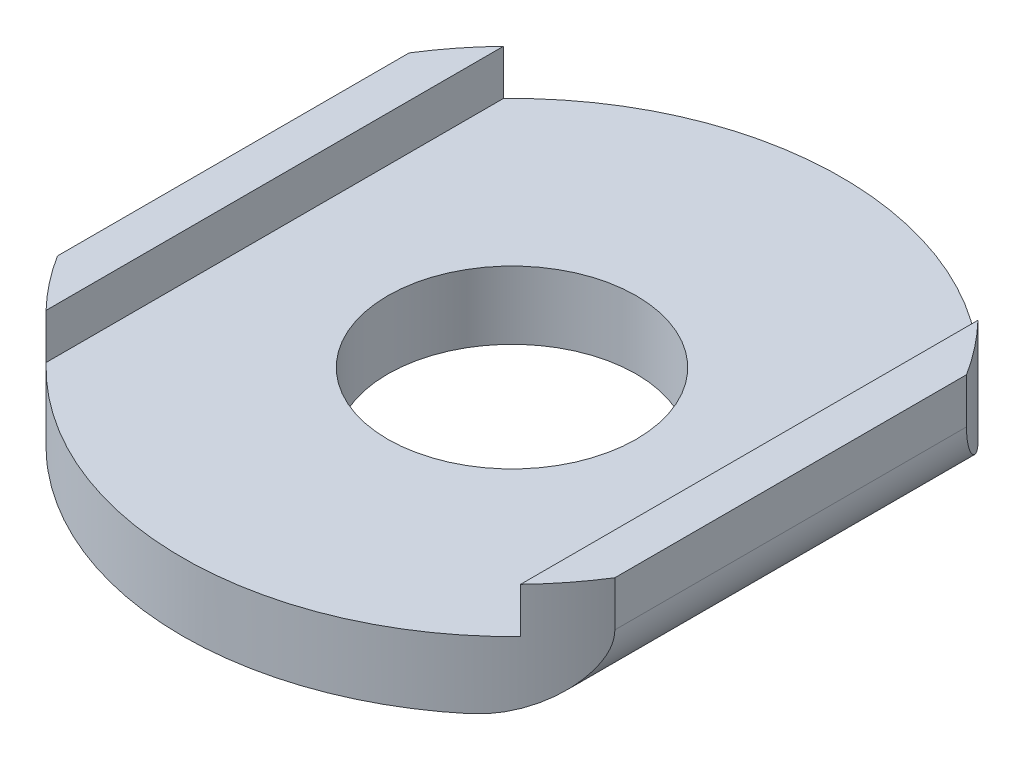
ISO-10303-21;
HEADER;
FILE_DESCRIPTION(('STEP AP214'),'2;1');
FILE_NAME('part.step','',(''),(''),'','','');
FILE_SCHEMA(('AUTOMOTIVE_DESIGN { 1 0 10303 214 1 1 1 1 }'));
ENDSEC;
DATA;
#1=APPLICATION_CONTEXT('core data for automotive mechanical design processes');
#2=APPLICATION_PROTOCOL_DEFINITION('international standard','automotive_design',2000,#1);
#3=PRODUCT_CONTEXT('',#1,'mechanical');
#4=PRODUCT('Part','Part','',(#3));
#5=PRODUCT_RELATED_PRODUCT_CATEGORY('part','',(#4));
#6=PRODUCT_DEFINITION_FORMATION('','',#4);
#7=PRODUCT_DEFINITION_CONTEXT('part definition',#1,'design');
#8=PRODUCT_DEFINITION('design','',#6,#7);
#9=PRODUCT_DEFINITION_SHAPE('','',#8);
#10=(LENGTH_UNIT() NAMED_UNIT(*) SI_UNIT(.MILLI.,.METRE.));
#11=(NAMED_UNIT(*) PLANE_ANGLE_UNIT() SI_UNIT($,.RADIAN.));
#12=(NAMED_UNIT(*) SI_UNIT($,.STERADIAN.) SOLID_ANGLE_UNIT());
#13=UNCERTAINTY_MEASURE_WITH_UNIT(LENGTH_MEASURE(1.E-05),#10,'distance_accuracy_value','');
#14=(GEOMETRIC_REPRESENTATION_CONTEXT(3) GLOBAL_UNCERTAINTY_ASSIGNED_CONTEXT((#13)) GLOBAL_UNIT_ASSIGNED_CONTEXT((#10,
#11,#12)) REPRESENTATION_CONTEXT('',''));
#15=CARTESIAN_POINT('',(0.,0.,0.));
#16=DIRECTION('',(0.,0.,1.));
#17=DIRECTION('',(1.,0.,0.));
#18=AXIS2_PLACEMENT_3D('',#15,#16,#17);
#19=CARTESIAN_POINT('',(0.,2.286,0.));
#20=DIRECTION('',(0.,1.,0.));
#21=DIRECTION('',(0.,0.,1.));
#22=AXIS2_PLACEMENT_3D('',#19,#20,#21);
#23=PLANE('',#22);
#24=DIRECTION('',(0.,0.,-1.));
#25=VECTOR('',#24,1.);
#26=CARTESIAN_POINT('',(8.001,2.286,7.71178677415292));
#27=LINE('',#26,#25);
#28=CARTESIAN_POINT('',(8.001,2.286,7.71178677415292));
#29=VERTEX_POINT('',#28);
#30=CARTESIAN_POINT('',(8.001,2.286,-7.71178677415293));
#31=VERTEX_POINT('',#30);
#32=EDGE_CURVE('E151',#29,#31,#27,.T.);
#33=ORIENTED_EDGE('',*,*,#32,.T.);
#34=CARTESIAN_POINT('',(0.,2.286,0.));
#35=DIRECTION('',(0.,1.,0.));
#36=DIRECTION('',(0.,0.,1.));
#37=AXIS2_PLACEMENT_3D('',#34,#35,#36);
#38=CIRCLE('',#37,11.1125);
#39=CARTESIAN_POINT('',(-8.001,2.286,-7.71178677415293));
#40=VERTEX_POINT('',#39);
#41=EDGE_CURVE('E208',#31,#40,#38,.T.);
#42=ORIENTED_EDGE('',*,*,#41,.T.);
#43=DIRECTION('',(0.,0.,1.));
#44=VECTOR('',#43,1.);
#45=CARTESIAN_POINT('',(-8.001,2.286,-7.71178677415293));
#46=LINE('',#45,#44);
#47=CARTESIAN_POINT('',(-8.001,2.286,7.71178677415293));
#48=VERTEX_POINT('',#47);
#49=EDGE_CURVE('E168',#40,#48,#46,.T.);
#50=ORIENTED_EDGE('',*,*,#49,.T.);
#51=EDGE_CURVE('E194',#48,#29,#38,.T.);
#52=ORIENTED_EDGE('',*,*,#51,.T.);
#53=EDGE_LOOP('',(#33,#42,#50,#52));
#54=FACE_BOUND('',#53,.T.);
#55=CARTESIAN_POINT('',(0.,2.286,0.));
#56=DIRECTION('',(0.,1.,0.));
#57=DIRECTION('',(0.,0.,1.));
#58=AXIS2_PLACEMENT_3D('',#55,#56,#57);
#59=CIRCLE('',#58,4.191);
#60=CARTESIAN_POINT('',(0.,2.286,4.191));
#61=VERTEX_POINT('',#60);
#62=EDGE_CURVE('E187',#61,#61,#59,.T.);
#63=ORIENTED_EDGE('',*,*,#62,.F.);
#64=EDGE_LOOP('',(#63));
#65=FACE_BOUND('',#64,.T.);
#66=ADVANCED_FACE('F47',(#54,#65),#23,.T.);
#67=CARTESIAN_POINT('',(0.,0.,0.));
#68=DIRECTION('',(0.,1.,0.));
#69=DIRECTION('',(0.,0.,1.));
#70=AXIS2_PLACEMENT_3D('',#67,#68,#69);
#71=PLANE('',#70);
#72=CARTESIAN_POINT('',(0.,0.,0.));
#73=DIRECTION('',(0.,1.,0.));
#74=DIRECTION('',(0.,0.,1.));
#75=AXIS2_PLACEMENT_3D('',#72,#73,#74);
#76=CIRCLE('',#75,4.191);
#77=CARTESIAN_POINT('',(0.,0.,4.191));
#78=VERTEX_POINT('',#77);
#79=EDGE_CURVE('E200',#78,#78,#76,.T.);
#80=ORIENTED_EDGE('',*,*,#79,.T.);
#81=EDGE_LOOP('',(#80));
#82=FACE_BOUND('',#81,.T.);
#83=CARTESIAN_POINT('',(0.,0.,0.));
#84=DIRECTION('',(0.,1.,0.));
#85=DIRECTION('',(0.,0.,1.));
#86=AXIS2_PLACEMENT_3D('',#83,#84,#85);
#87=CIRCLE('',#86,11.1125);
#88=CARTESIAN_POINT('',(-7.112,0.,8.5385661706167));
#89=VERTEX_POINT('',#88);
#90=CARTESIAN_POINT('',(7.112,0.,8.5385661706167));
#91=VERTEX_POINT('',#90);
#92=EDGE_CURVE('E220',#89,#91,#87,.T.);
#93=ORIENTED_EDGE('',*,*,#92,.F.);
#94=DIRECTION('',(0.,0.,-1.));
#95=VECTOR('',#94,1.);
#96=CARTESIAN_POINT('',(-7.112,0.,0.));
#97=LINE('',#96,#95);
#98=CARTESIAN_POINT('',(-7.112,0.,-8.5385661706167));
#99=VERTEX_POINT('',#98);
#100=EDGE_CURVE('E230',#89,#99,#97,.T.);
#101=ORIENTED_EDGE('',*,*,#100,.T.);
#102=CARTESIAN_POINT('',(7.112,0.,-8.5385661706167));
#103=VERTEX_POINT('',#102);
#104=EDGE_CURVE('E215',#103,#99,#87,.T.);
#105=ORIENTED_EDGE('',*,*,#104,.F.);
#106=DIRECTION('',(0.,0.,-1.));
#107=VECTOR('',#106,1.);
#108=CARTESIAN_POINT('',(7.112,0.,5.93002970060016));
#109=LINE('',#108,#107);
#110=EDGE_CURVE('E211',#103,#91,#109,.F.);
#111=ORIENTED_EDGE('',*,*,#110,.T.);
#112=EDGE_LOOP('',(#93,#101,#105,#111));
#113=FACE_BOUND('',#112,.T.);
#114=ADVANCED_FACE('F259',(#82,#113),#71,.F.);
#115=CARTESIAN_POINT('',(0.,2.286,0.));
#116=DIRECTION('',(0.,-1.,0.));
#117=DIRECTION('',(0.,0.,-1.));
#118=AXIS2_PLACEMENT_3D('',#115,#116,#117);
#119=CYLINDRICAL_SURFACE('',#118,11.1125);
#120=DIRECTION('',(0.,-1.,0.));
#121=VECTOR('',#120,1.);
#122=CARTESIAN_POINT('',(-9.398,2.286,5.93002970060016));
#123=LINE('',#122,#121);
#124=CARTESIAN_POINT('',(-9.398,3.81,5.93002970060016));
#125=VERTEX_POINT('',#124);
#126=CARTESIAN_POINT('',(-9.398,2.286,5.93002970060016));
#127=VERTEX_POINT('',#126);
#128=EDGE_CURVE('E224',#125,#127,#123,.T.);
#129=ORIENTED_EDGE('',*,*,#128,.T.);
#130=CARTESIAN_POINT('',(-9.398,2.286,5.93002970060016));
#131=CARTESIAN_POINT('',(-9.39800542832449,2.24859124822343,5.93001859917292));
#132=CARTESIAN_POINT('',(-9.39708117956693,2.21120325674337,5.93148605541066));
#133=CARTESIAN_POINT('',(-9.39342746670743,2.13678157078077,5.93727166517478));
#134=CARTESIAN_POINT('',(-9.39070018660907,2.09974750258098,5.94158636983064));
#135=CARTESIAN_POINT('',(-9.37997998796292,1.99041208395754,5.95850773639661));
#136=CARTESIAN_POINT('',(-9.36944571426099,1.91894558609183,5.97509734061076));
#137=CARTESIAN_POINT('',(-9.3387493946673,1.76111468181681,6.02298989524821));
#138=CARTESIAN_POINT('',(-9.31674949831865,1.67597599222489,6.05706526847402));
#139=CARTESIAN_POINT('',(-9.26504372086777,1.51297568733057,6.13586653105624));
#140=CARTESIAN_POINT('',(-9.23529793439938,1.43515468377865,6.18064747259055));
#141=CARTESIAN_POINT('',(-9.15042368808795,1.24328464266163,6.30602489991684));
#142=CARTESIAN_POINT('',(-9.09067490494017,1.13495596669138,6.39216265413357));
#143=CARTESIAN_POINT('',(-8.95982512122971,0.934828690230264,6.57433549692152));
#144=CARTESIAN_POINT('',(-8.8886976200423,0.843069768981605,6.67039349960054));
#145=CARTESIAN_POINT('',(-8.75425253669401,0.693367743048383,6.84543820866373));
#146=CARTESIAN_POINT('',(-8.69280517246391,0.632469683061008,6.92337422399777));
#147=CARTESIAN_POINT('',(-8.56479726036357,0.518939682055099,7.08111731530681));
#148=CARTESIAN_POINT('',(-8.49823414869888,0.466311926517888,7.16092531533631));
#149=CARTESIAN_POINT('',(-8.36044167379823,0.369156618210445,7.32132846328396));
#150=CARTESIAN_POINT('',(-8.28921488600291,0.324624645140967,7.40192315618372));
#151=CARTESIAN_POINT('',(-8.14236126625213,0.243653144980316,7.56316722621634));
#152=CARTESIAN_POINT('',(-8.06673463931575,0.207213241203928,7.64381660062842));
#153=CARTESIAN_POINT('',(-7.92144639462134,0.146852611877388,7.79408807302852));
#154=CARTESIAN_POINT('',(-7.85228078225119,0.121921714577022,7.86378555079576));
#155=CARTESIAN_POINT('',(-7.71108053291243,0.0786602923968829,8.00229177075103));
#156=CARTESIAN_POINT('',(-7.63904660548163,0.0603281463052077,8.07110072722427));
#157=CARTESIAN_POINT('',(-7.4924692371833,0.0306452971306605,8.20734678390782));
#158=CARTESIAN_POINT('',(-7.41792946670669,0.0192848153603831,8.27478567675706));
#159=CARTESIAN_POINT('',(-7.26656946250003,0.00396538627212807,8.4080233279135));
#160=CARTESIAN_POINT('',(-7.18974766416919,1.16419608203905E-05,8.47382090125403));
#161=CARTESIAN_POINT('',(-7.112,0.,8.5385661706167));
#162=B_SPLINE_CURVE_WITH_KNOTS('',3,(#130,#131,#132,#133,#134,#135,#136,#137,#138,#139,#140,
#141,#142,#143,#144,#145,#146,#147,#148,#149,#150,#151,#152,#153,#154,#155,#156,#157,#158,#159,
#160,#161),.UNSPECIFIED.,.F.,.F.,(4,2,2,2,2,2,2,2,2,2,2,2,2,2,2,4),(0.,0.112148194286111,
0.224160792267741,0.445430951034699,0.726799482247436,1.00964728055068,1.45940279909495,
1.91022145389977,2.25911155288715,2.60817765538779,2.9570525915186,3.30591128414157,
3.60958774073972,3.91318953768723,4.21636451352214,4.51975238076639),.UNSPECIFIED.);
#163=EDGE_CURVE('E57',#127,#89,#162,.T.);
#164=ORIENTED_EDGE('',*,*,#163,.T.);
#165=ORIENTED_EDGE('',*,*,#92,.T.);
#166=CARTESIAN_POINT('',(7.112,0.,8.5385661706167));
#167=CARTESIAN_POINT('',(7.18624783770357,9.55986294095027E-06,8.47673394639975));
#168=CARTESIAN_POINT('',(7.25965419187097,0.00361652744253923,8.41394138515596));
#169=CARTESIAN_POINT('',(7.40440232688452,0.0176105432817177,8.28683917991667));
#170=CARTESIAN_POINT('',(7.47574540770995,0.0279932207861875,8.22253053964482));
#171=CARTESIAN_POINT('',(7.6161914936765,0.055146172968759,8.09261780883084));
#172=CARTESIAN_POINT('',(7.68529082770172,0.0719263947141895,8.02701185256434));
#173=CARTESIAN_POINT('',(7.82090373214223,0.111547530125733,7.8949401405817));
#174=CARTESIAN_POINT('',(7.88741669681067,0.13438985389515,7.82847418824837));
#175=CARTESIAN_POINT('',(8.02849363724578,0.190168566945718,7.68392934508702));
#176=CARTESIAN_POINT('',(8.1025529589111,0.224152599297627,7.60576042494889));
#177=CARTESIAN_POINT('',(8.2465833225312,0.299763929883269,7.44935059594484));
#178=CARTESIAN_POINT('',(8.31655412148883,0.341391681805773,7.37110968308026));
#179=CARTESIAN_POINT('',(8.45213271752299,0.432220121728584,7.21524581429941));
#180=CARTESIAN_POINT('',(8.51774085954114,0.481420209985965,7.13762280995527));
#181=CARTESIAN_POINT('',(8.64424667950922,0.587522093221697,6.98387883516002));
#182=CARTESIAN_POINT('',(8.70514644927474,0.644420436793427,6.90775720901056));
#183=CARTESIAN_POINT('',(8.83576979870336,0.780888509263855,6.74022374488726));
#184=CARTESIAN_POINT('',(8.90413296333204,0.862628685835154,6.6494959690971));
#185=CARTESIAN_POINT('',(9.03161323432094,1.03989118257504,6.47527578262391));
#186=CARTESIAN_POINT('',(9.09074469978514,1.13539164572997,6.39177222735557));
#187=CARTESIAN_POINT('',(9.18183800254154,1.31215411892032,6.259870155309));
#188=CARTESIAN_POINT('',(9.21670812361123,1.38952553689501,6.20830999456582));
#189=CARTESIAN_POINT('',(9.27896960105321,1.55276482389918,6.11486047969852));
#190=CARTESIAN_POINT('',(9.30637226672487,1.63861957334121,6.07295651650152));
#191=CARTESIAN_POINT('',(9.34605485420707,1.79640026663368,6.0116485913128));
#192=CARTESIAN_POINT('',(9.36039215301158,1.86663119321115,5.98925074841319));
#193=CARTESIAN_POINT('',(9.38249262127312,2.010484199052,5.95457172422237));
#194=CARTESIAN_POINT('',(9.3902746796941,2.08409588576481,5.94226147826771));
#195=CARTESIAN_POINT('',(9.39561928171835,2.17952767150739,5.93380112021695));
#196=CARTESIAN_POINT('',(9.3965110960586,2.20078806568058,5.93238870531214));
#197=CARTESIAN_POINT('',(9.39770100095002,2.24336284605287,5.93050371938829));
#198=CARTESIAN_POINT('',(9.3979992082216,2.26467722081238,5.93003096360496));
#199=CARTESIAN_POINT('',(9.39800000000002,2.28600000000006,5.93002970060085));
#200=B_SPLINE_CURVE_WITH_KNOTS('',3,(#166,#167,#168,#169,#170,#171,#172,#173,#174,#175,#176,
#177,#178,#179,#180,#181,#182,#183,#184,#185,#186,#187,#188,#189,#190,#191,#192,#193,#194,#195,
#196,#197,#198,#199),.UNSPECIFIED.,.F.,.F.,(4,2,2,2,2,2,2,2,2,2,2,2,2,2,2,2,4),(0.,
0.289746907047424,0.5793070937861,0.869319344475967,1.15939911402538,1.49780304773987,
1.83622707373014,2.1746243096971,2.51287032958479,2.93180103094839,3.35007348690386,
3.64716741024161,3.94380885860732,4.16825898361589,4.39206012008452,4.45601708712088,
4.51996147711488),.UNSPECIFIED.);
#201=CARTESIAN_POINT('',(9.398,2.286,5.93002970060016));
#202=VERTEX_POINT('',#201);
#203=EDGE_CURVE('E64',#91,#202,#200,.T.);
#204=ORIENTED_EDGE('',*,*,#203,.T.);
#205=DIRECTION('',(0.,-1.,0.));
#206=VECTOR('',#205,1.);
#207=CARTESIAN_POINT('',(9.398,2.286,5.93002970060016));
#208=LINE('',#207,#206);
#209=CARTESIAN_POINT('',(9.398,3.81,5.93002970060016));
#210=VERTEX_POINT('',#209);
#211=EDGE_CURVE('E126',#210,#202,#208,.T.);
#212=ORIENTED_EDGE('',*,*,#211,.F.);
#213=CARTESIAN_POINT('',(0.,3.81,0.));
#214=DIRECTION('',(0.,1.,0.));
#215=DIRECTION('',(0.,0.,1.));
#216=AXIS2_PLACEMENT_3D('',#213,#214,#215);
#217=CIRCLE('',#216,11.1125);
#218=CARTESIAN_POINT('',(8.001,3.81,7.71178677415292));
#219=VERTEX_POINT('',#218);
#220=EDGE_CURVE('E130',#219,#210,#217,.T.);
#221=ORIENTED_EDGE('',*,*,#220,.F.);
#222=DIRECTION('',(0.,-1.,0.));
#223=VECTOR('',#222,1.);
#224=CARTESIAN_POINT('',(8.001,3.81,7.71178677415292));
#225=LINE('',#224,#223);
#226=EDGE_CURVE('E161',#219,#29,#225,.T.);
#227=ORIENTED_EDGE('',*,*,#226,.T.);
#228=ORIENTED_EDGE('',*,*,#51,.F.);
#229=DIRECTION('',(0.,-1.,0.));
#230=VECTOR('',#229,1.);
#231=CARTESIAN_POINT('',(-8.001,3.81,7.71178677415292));
#232=LINE('',#231,#230);
#233=CARTESIAN_POINT('',(-8.001,3.81,7.71178677415292));
#234=VERTEX_POINT('',#233);
#235=EDGE_CURVE('E197',#234,#48,#232,.T.);
#236=ORIENTED_EDGE('',*,*,#235,.F.);
#237=CARTESIAN_POINT('',(0.,3.81,0.));
#238=DIRECTION('',(0.,1.,0.));
#239=DIRECTION('',(0.,0.,1.));
#240=AXIS2_PLACEMENT_3D('',#237,#238,#239);
#241=CIRCLE('',#240,11.1125);
#242=EDGE_CURVE('E177',#125,#234,#241,.T.);
#243=ORIENTED_EDGE('',*,*,#242,.F.);
#244=EDGE_LOOP('',(#129,#164,#165,#204,#212,#221,#227,#228,#236,#243));
#245=FACE_BOUND('',#244,.T.);
#246=ADVANCED_FACE('F128',(#245),#119,.T.);
#247=ORIENTED_EDGE('',*,*,#104,.T.);
#248=CARTESIAN_POINT('',(-7.112,0.,-8.5385661706167));
#249=CARTESIAN_POINT('',(-7.18624783770357,9.55986294095027E-06,-8.47673394639975));
#250=CARTESIAN_POINT('',(-7.25965419187097,0.00361652744253923,-8.41394138515596));
#251=CARTESIAN_POINT('',(-7.40440232688452,0.0176105432817177,-8.28683917991667));
#252=CARTESIAN_POINT('',(-7.47574540770995,0.0279932207861875,-8.22253053964482));
#253=CARTESIAN_POINT('',(-7.6161914936765,0.055146172968759,-8.09261780883084));
#254=CARTESIAN_POINT('',(-7.68529082770172,0.0719263947141895,-8.02701185256434));
#255=CARTESIAN_POINT('',(-7.82090373214223,0.111547530125733,-7.8949401405817));
#256=CARTESIAN_POINT('',(-7.88741669681067,0.13438985389515,-7.82847418824837));
#257=CARTESIAN_POINT('',(-8.02849363724578,0.190168566945718,-7.68392934508702));
#258=CARTESIAN_POINT('',(-8.1025529589111,0.224152599297627,-7.60576042494889));
#259=CARTESIAN_POINT('',(-8.2465833225312,0.299763929883269,-7.44935059594484));
#260=CARTESIAN_POINT('',(-8.31655412148883,0.341391681805773,-7.37110968308026));
#261=CARTESIAN_POINT('',(-8.45213271752299,0.432220121728584,-7.21524581429941));
#262=CARTESIAN_POINT('',(-8.51774085954114,0.481420209985965,-7.13762280995527));
#263=CARTESIAN_POINT('',(-8.64424667950922,0.587522093221697,-6.98387883516002));
#264=CARTESIAN_POINT('',(-8.70514644927474,0.644420436793427,-6.90775720901056));
#265=CARTESIAN_POINT('',(-8.83576979870336,0.780888509263855,-6.74022374488726));
#266=CARTESIAN_POINT('',(-8.90413296333204,0.862628685835154,-6.6494959690971));
#267=CARTESIAN_POINT('',(-9.03161323432094,1.03989118257504,-6.47527578262391));
#268=CARTESIAN_POINT('',(-9.09074469978514,1.13539164572997,-6.39177222735557));
#269=CARTESIAN_POINT('',(-9.18183800254154,1.31215411892032,-6.259870155309));
#270=CARTESIAN_POINT('',(-9.21670812361123,1.38952553689501,-6.20830999456582));
#271=CARTESIAN_POINT('',(-9.27896960105321,1.55276482389918,-6.11486047969852));
#272=CARTESIAN_POINT('',(-9.30637226672487,1.63861957334121,-6.07295651650152));
#273=CARTESIAN_POINT('',(-9.34605485420707,1.79640026663368,-6.0116485913128));
#274=CARTESIAN_POINT('',(-9.36039215301158,1.86663119321115,-5.98925074841319));
#275=CARTESIAN_POINT('',(-9.38249262127312,2.010484199052,-5.95457172422237));
#276=CARTESIAN_POINT('',(-9.3902746796941,2.08409588576481,-5.94226147826771));
#277=CARTESIAN_POINT('',(-9.39561928171835,2.17952767150739,-5.93380112021695));
#278=CARTESIAN_POINT('',(-9.3965110960586,2.20078806568058,-5.93238870531214));
#279=CARTESIAN_POINT('',(-9.39770100095002,2.24336284605287,-5.93050371938829));
#280=CARTESIAN_POINT('',(-9.3979992082216,2.26467722081238,-5.93003096360496));
#281=CARTESIAN_POINT('',(-9.39800000000002,2.28600000000006,-5.93002970060085));
#282=B_SPLINE_CURVE_WITH_KNOTS('',3,(#248,#249,#250,#251,#252,#253,#254,#255,#256,#257,#258,
#259,#260,#261,#262,#263,#264,#265,#266,#267,#268,#269,#270,#271,#272,#273,#274,#275,#276,#277,
#278,#279,#280,#281),.UNSPECIFIED.,.F.,.F.,(4,2,2,2,2,2,2,2,2,2,2,2,2,2,2,2,4),(0.,
0.289746907047424,0.5793070937861,0.869319344475967,1.15939911402538,1.49780304773987,
1.83622707373014,2.1746243096971,2.51287032958479,2.93180103094839,3.35007348690386,
3.64716741024161,3.94380885860732,4.16825898361589,4.39206012008452,4.45601708712088,
4.51996147711488),.UNSPECIFIED.);
#283=CARTESIAN_POINT('',(-9.398,2.286,-5.93002970060016));
#284=VERTEX_POINT('',#283);
#285=EDGE_CURVE('E242',#99,#284,#282,.T.);
#286=ORIENTED_EDGE('',*,*,#285,.T.);
#287=DIRECTION('',(0.,-1.,0.));
#288=VECTOR('',#287,1.);
#289=CARTESIAN_POINT('',(-9.398,2.286,-5.93002970060016));
#290=LINE('',#289,#288);
#291=CARTESIAN_POINT('',(-9.398,3.81,-5.93002970060016));
#292=VERTEX_POINT('',#291);
#293=EDGE_CURVE('E135',#284,#292,#290,.F.);
#294=ORIENTED_EDGE('',*,*,#293,.T.);
#295=CARTESIAN_POINT('',(0.,3.81,0.));
#296=DIRECTION('',(0.,1.,0.));
#297=DIRECTION('',(0.,0.,1.));
#298=AXIS2_PLACEMENT_3D('',#295,#296,#297);
#299=CIRCLE('',#298,11.1125);
#300=CARTESIAN_POINT('',(-8.001,3.81,-7.71178677415293));
#301=VERTEX_POINT('',#300);
#302=EDGE_CURVE('E169',#301,#292,#299,.T.);
#303=ORIENTED_EDGE('',*,*,#302,.F.);
#304=DIRECTION('',(0.,-1.,0.));
#305=VECTOR('',#304,1.);
#306=CARTESIAN_POINT('',(-8.001,3.81,-7.71178677415293));
#307=LINE('',#306,#305);
#308=EDGE_CURVE('E184',#301,#40,#307,.T.);
#309=ORIENTED_EDGE('',*,*,#308,.T.);
#310=ORIENTED_EDGE('',*,*,#41,.F.);
#311=DIRECTION('',(0.,-1.,0.));
#312=VECTOR('',#311,1.);
#313=CARTESIAN_POINT('',(8.001,3.81,-7.71178677415293));
#314=LINE('',#313,#312);
#315=CARTESIAN_POINT('',(8.001,3.81,-7.71178677415293));
#316=VERTEX_POINT('',#315);
#317=EDGE_CURVE('E165',#316,#31,#314,.T.);
#318=ORIENTED_EDGE('',*,*,#317,.F.);
#319=CARTESIAN_POINT('',(0.,3.81,0.));
#320=DIRECTION('',(0.,1.,0.));
#321=DIRECTION('',(0.,0.,1.));
#322=AXIS2_PLACEMENT_3D('',#319,#320,#321);
#323=CIRCLE('',#322,11.1125);
#324=CARTESIAN_POINT('',(9.398,3.81,-5.93002970060016));
#325=VERTEX_POINT('',#324);
#326=EDGE_CURVE('E145',#325,#316,#323,.T.);
#327=ORIENTED_EDGE('',*,*,#326,.F.);
#328=DIRECTION('',(0.,-1.,0.));
#329=VECTOR('',#328,1.);
#330=CARTESIAN_POINT('',(9.398,2.286,-5.93002970060016));
#331=LINE('',#330,#329);
#332=CARTESIAN_POINT('',(9.398,2.286,-5.93002970060016));
#333=VERTEX_POINT('',#332);
#334=EDGE_CURVE('E136',#333,#325,#331,.F.);
#335=ORIENTED_EDGE('',*,*,#334,.F.);
#336=CARTESIAN_POINT('',(9.398,2.286,-5.93002970060016));
#337=CARTESIAN_POINT('',(9.39800542832449,2.24859124822343,-5.93001859917292));
#338=CARTESIAN_POINT('',(9.39708117956693,2.21120325674337,-5.93148605541066));
#339=CARTESIAN_POINT('',(9.39342746670743,2.13678157078077,-5.93727166517478));
#340=CARTESIAN_POINT('',(9.39070018660907,2.09974750258098,-5.94158636983064));
#341=CARTESIAN_POINT('',(9.37997998796292,1.99041208395754,-5.95850773639661));
#342=CARTESIAN_POINT('',(9.36944571426099,1.91894558609183,-5.97509734061076));
#343=CARTESIAN_POINT('',(9.3387493946673,1.76111468181681,-6.02298989524821));
#344=CARTESIAN_POINT('',(9.31674949831865,1.67597599222489,-6.05706526847402));
#345=CARTESIAN_POINT('',(9.26504372086777,1.51297568733057,-6.13586653105624));
#346=CARTESIAN_POINT('',(9.23529793439938,1.43515468377865,-6.18064747259055));
#347=CARTESIAN_POINT('',(9.15042368808795,1.24328464266163,-6.30602489991684));
#348=CARTESIAN_POINT('',(9.09067490494017,1.13495596669138,-6.39216265413357));
#349=CARTESIAN_POINT('',(8.95982512122971,0.934828690230264,-6.57433549692152));
#350=CARTESIAN_POINT('',(8.8886976200423,0.843069768981605,-6.67039349960054));
#351=CARTESIAN_POINT('',(8.75425253669401,0.693367743048383,-6.84543820866373));
#352=CARTESIAN_POINT('',(8.69280517246391,0.632469683061008,-6.92337422399777));
#353=CARTESIAN_POINT('',(8.56479726036357,0.518939682055099,-7.08111731530681));
#354=CARTESIAN_POINT('',(8.49823414869888,0.466311926517888,-7.16092531533631));
#355=CARTESIAN_POINT('',(8.36044167379823,0.369156618210445,-7.32132846328396));
#356=CARTESIAN_POINT('',(8.28921488600291,0.324624645140967,-7.40192315618372));
#357=CARTESIAN_POINT('',(8.14236126625213,0.243653144980316,-7.56316722621634));
#358=CARTESIAN_POINT('',(8.06673463931575,0.207213241203928,-7.64381660062842));
#359=CARTESIAN_POINT('',(7.92144639462134,0.146852611877388,-7.79408807302852));
#360=CARTESIAN_POINT('',(7.85228078225119,0.121921714577022,-7.86378555079576));
#361=CARTESIAN_POINT('',(7.71108053291243,0.0786602923968829,-8.00229177075103));
#362=CARTESIAN_POINT('',(7.63904660548163,0.0603281463052077,-8.07110072722427));
#363=CARTESIAN_POINT('',(7.4924692371833,0.0306452971306605,-8.20734678390782));
#364=CARTESIAN_POINT('',(7.41792946670669,0.0192848153603831,-8.27478567675706));
#365=CARTESIAN_POINT('',(7.26656946250003,0.00396538627212807,-8.4080233279135));
#366=CARTESIAN_POINT('',(7.18974766416919,1.16419608203905E-05,-8.47382090125403));
#367=CARTESIAN_POINT('',(7.112,0.,-8.5385661706167));
#368=B_SPLINE_CURVE_WITH_KNOTS('',3,(#336,#337,#338,#339,#340,#341,#342,#343,#344,#345,#346,
#347,#348,#349,#350,#351,#352,#353,#354,#355,#356,#357,#358,#359,#360,#361,#362,#363,#364,#365,
#366,#367),.UNSPECIFIED.,.F.,.F.,(4,2,2,2,2,2,2,2,2,2,2,2,2,2,2,4),(0.,0.112148194286111,
0.224160792267741,0.445430951034699,0.726799482247436,1.00964728055068,1.45940279909495,
1.91022145389977,2.25911155288715,2.60817765538779,2.9570525915186,3.30591128414157,
3.60958774073972,3.91318953768723,4.21636451352214,4.51975238076639),.UNSPECIFIED.);
#369=EDGE_CURVE('E238',#333,#103,#368,.T.);
#370=ORIENTED_EDGE('',*,*,#369,.T.);
#371=EDGE_LOOP('',(#247,#286,#294,#303,#309,#310,#318,#327,#335,#370));
#372=FACE_BOUND('',#371,.T.);
#373=ADVANCED_FACE('F258',(#372),#119,.T.);
#374=CARTESIAN_POINT('',(0.,2.286,0.));
#375=DIRECTION('',(0.,-1.,0.));
#376=DIRECTION('',(0.,0.,-1.));
#377=AXIS2_PLACEMENT_3D('',#374,#375,#376);
#378=CYLINDRICAL_SURFACE('',#377,4.191);
#379=ORIENTED_EDGE('',*,*,#62,.T.);
#380=EDGE_LOOP('',(#379));
#381=FACE_BOUND('',#380,.T.);
#382=ORIENTED_EDGE('',*,*,#79,.F.);
#383=EDGE_LOOP('',(#382));
#384=FACE_BOUND('',#383,.T.);
#385=ADVANCED_FACE('F370',(#381,#384),#378,.F.);
#386=CARTESIAN_POINT('',(9.398,2.286,-10.0274859943978));
#387=DIRECTION('',(1.,0.,0.));
#388=DIRECTION('',(0.,0.,-1.));
#389=AXIS2_PLACEMENT_3D('',#386,#387,#388);
#390=PLANE('',#389);
#391=ORIENTED_EDGE('',*,*,#211,.T.);
#392=DIRECTION('',(0.,0.,-1.));
#393=VECTOR('',#392,1.);
#394=CARTESIAN_POINT('',(9.398,2.286,-5.93002970060016));
#395=LINE('',#394,#393);
#396=EDGE_CURVE('E11',#202,#333,#395,.T.);
#397=ORIENTED_EDGE('',*,*,#396,.T.);
#398=ORIENTED_EDGE('',*,*,#334,.T.);
#399=DIRECTION('',(0.,0.,-1.));
#400=VECTOR('',#399,1.);
#401=CARTESIAN_POINT('',(9.398,3.81,5.93002970060016));
#402=LINE('',#401,#400);
#403=EDGE_CURVE('E139',#210,#325,#402,.T.);
#404=ORIENTED_EDGE('',*,*,#403,.F.);
#405=EDGE_LOOP('',(#391,#397,#398,#404));
#406=FACE_BOUND('',#405,.T.);
#407=ADVANCED_FACE('F140',(#406),#390,.T.);
#408=CARTESIAN_POINT('',(-9.398,2.286,-10.0274859943978));
#409=DIRECTION('',(1.,0.,0.));
#410=DIRECTION('',(0.,0.,-1.));
#411=AXIS2_PLACEMENT_3D('',#408,#409,#410);
#412=PLANE('',#411);
#413=ORIENTED_EDGE('',*,*,#293,.F.);
#414=DIRECTION('',(0.,0.,-1.));
#415=VECTOR('',#414,1.);
#416=CARTESIAN_POINT('',(-9.398,2.286,-10.0274859943978));
#417=LINE('',#416,#415);
#418=EDGE_CURVE('E72',#284,#127,#417,.F.);
#419=ORIENTED_EDGE('',*,*,#418,.T.);
#420=ORIENTED_EDGE('',*,*,#128,.F.);
#421=DIRECTION('',(0.,0.,1.));
#422=VECTOR('',#421,1.);
#423=CARTESIAN_POINT('',(-9.398,3.81,-5.93002970060016));
#424=LINE('',#423,#422);
#425=EDGE_CURVE('E173',#292,#125,#424,.T.);
#426=ORIENTED_EDGE('',*,*,#425,.F.);
#427=EDGE_LOOP('',(#413,#419,#420,#426));
#428=FACE_BOUND('',#427,.T.);
#429=ADVANCED_FACE('F289',(#428),#412,.F.);
#430=CARTESIAN_POINT('',(-8.001,3.81,-7.71178677415293));
#431=DIRECTION('',(1.,0.,0.));
#432=DIRECTION('',(0.,0.,-1.));
#433=AXIS2_PLACEMENT_3D('',#430,#431,#432);
#434=PLANE('',#433);
#435=ORIENTED_EDGE('',*,*,#49,.F.);
#436=ORIENTED_EDGE('',*,*,#308,.F.);
#437=DIRECTION('',(0.,0.,1.));
#438=VECTOR('',#437,1.);
#439=CARTESIAN_POINT('',(-8.001,3.81,-7.71178677415293));
#440=LINE('',#439,#438);
#441=EDGE_CURVE('E180',#301,#234,#440,.T.);
#442=ORIENTED_EDGE('',*,*,#441,.T.);
#443=ORIENTED_EDGE('',*,*,#235,.T.);
#444=EDGE_LOOP('',(#435,#436,#442,#443));
#445=FACE_BOUND('',#444,.T.);
#446=ADVANCED_FACE('F297',(#445),#434,.T.);
#447=CARTESIAN_POINT('',(0.,3.81,0.));
#448=DIRECTION('',(0.,1.,0.));
#449=DIRECTION('',(0.,0.,1.));
#450=AXIS2_PLACEMENT_3D('',#447,#448,#449);
#451=PLANE('',#450);
#452=ORIENTED_EDGE('',*,*,#302,.T.);
#453=ORIENTED_EDGE('',*,*,#425,.T.);
#454=ORIENTED_EDGE('',*,*,#242,.T.);
#455=ORIENTED_EDGE('',*,*,#441,.F.);
#456=EDGE_LOOP('',(#452,#453,#454,#455));
#457=FACE_BOUND('',#456,.T.);
#458=ADVANCED_FACE('F292',(#457),#451,.T.);
#459=CARTESIAN_POINT('',(8.001,3.81,7.71178677415292));
#460=DIRECTION('',(-1.,0.,0.));
#461=DIRECTION('',(0.,0.,1.));
#462=AXIS2_PLACEMENT_3D('',#459,#460,#461);
#463=PLANE('',#462);
#464=ORIENTED_EDGE('',*,*,#32,.F.);
#465=ORIENTED_EDGE('',*,*,#226,.F.);
#466=DIRECTION('',(0.,0.,-1.));
#467=VECTOR('',#466,1.);
#468=CARTESIAN_POINT('',(8.001,3.81,7.71178677415292));
#469=LINE('',#468,#467);
#470=EDGE_CURVE('E149',#219,#316,#469,.T.);
#471=ORIENTED_EDGE('',*,*,#470,.T.);
#472=ORIENTED_EDGE('',*,*,#317,.T.);
#473=EDGE_LOOP('',(#464,#465,#471,#472));
#474=FACE_BOUND('',#473,.T.);
#475=ADVANCED_FACE('F412',(#474),#463,.T.);
#476=CARTESIAN_POINT('',(0.,3.81,0.));
#477=DIRECTION('',(0.,1.,0.));
#478=DIRECTION('',(0.,0.,1.));
#479=AXIS2_PLACEMENT_3D('',#476,#477,#478);
#480=PLANE('',#479);
#481=ORIENTED_EDGE('',*,*,#220,.T.);
#482=ORIENTED_EDGE('',*,*,#403,.T.);
#483=ORIENTED_EDGE('',*,*,#326,.T.);
#484=ORIENTED_EDGE('',*,*,#470,.F.);
#485=EDGE_LOOP('',(#481,#482,#483,#484));
#486=FACE_BOUND('',#485,.T.);
#487=ADVANCED_FACE('F147',(#486),#480,.T.);
#488=CARTESIAN_POINT('',(-7.112,2.286,0.));
#489=DIRECTION('',(0.,0.,-1.));
#490=DIRECTION('',(-1.,0.,0.));
#491=AXIS2_PLACEMENT_3D('',#488,#489,#490);
#492=CYLINDRICAL_SURFACE('',#491,2.286);
#493=ORIENTED_EDGE('',*,*,#163,.F.);
#494=ORIENTED_EDGE('',*,*,#418,.F.);
#495=ORIENTED_EDGE('',*,*,#285,.F.);
#496=ORIENTED_EDGE('',*,*,#100,.F.);
#497=EDGE_LOOP('',(#493,#494,#495,#496));
#498=FACE_BOUND('',#497,.T.);
#499=ADVANCED_FACE('F261',(#498),#492,.T.);
#500=CARTESIAN_POINT('',(7.112,2.286,-10.0274859943978));
#501=DIRECTION('',(0.,0.,1.));
#502=DIRECTION('',(1.,0.,0.));
#503=AXIS2_PLACEMENT_3D('',#500,#501,#502);
#504=CYLINDRICAL_SURFACE('',#503,2.286);
#505=ORIENTED_EDGE('',*,*,#203,.F.);
#506=ORIENTED_EDGE('',*,*,#110,.F.);
#507=ORIENTED_EDGE('',*,*,#369,.F.);
#508=ORIENTED_EDGE('',*,*,#396,.F.);
#509=EDGE_LOOP('',(#505,#506,#507,#508));
#510=FACE_BOUND('',#509,.T.);
#511=ADVANCED_FACE('F49',(#510),#504,.T.);
#512=CLOSED_SHELL('',(#66,#114,#246,#373,#385,#407,#429,#446,#458,#475,#487,#499,#511));
#513=MANIFOLD_SOLID_BREP('B2',#512);
#514=ADVANCED_BREP_SHAPE_REPRESENTATION('',(#18,#513),#14);
#515=SHAPE_DEFINITION_REPRESENTATION(#9,#514);
ENDSEC;
END-ISO-10303-21;
